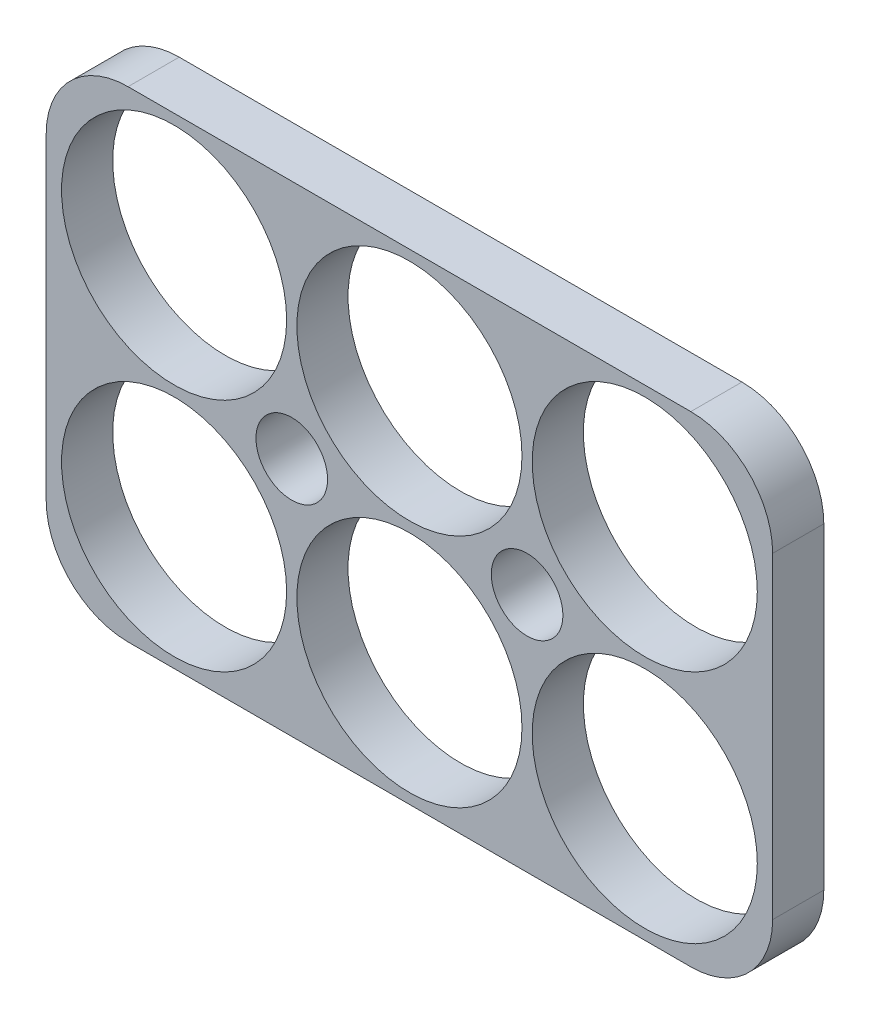
ISO-10303-21;
HEADER;
FILE_DESCRIPTION(('STEP AP214'),'2;1');
FILE_NAME('part.step','',(''),(''),'','','');
FILE_SCHEMA(('AUTOMOTIVE_DESIGN { 1 0 10303 214 1 1 1 1 }'));
ENDSEC;
DATA;
#1=APPLICATION_CONTEXT('core data for automotive mechanical design processes');
#2=APPLICATION_PROTOCOL_DEFINITION('international standard','automotive_design',2000,#1);
#3=PRODUCT_CONTEXT('',#1,'mechanical');
#4=PRODUCT('Part','Part','',(#3));
#5=PRODUCT_RELATED_PRODUCT_CATEGORY('part','',(#4));
#6=PRODUCT_DEFINITION_FORMATION('','',#4);
#7=PRODUCT_DEFINITION_CONTEXT('part definition',#1,'design');
#8=PRODUCT_DEFINITION('design','',#6,#7);
#9=PRODUCT_DEFINITION_SHAPE('','',#8);
#10=(LENGTH_UNIT() NAMED_UNIT(*) SI_UNIT(.MILLI.,.METRE.));
#11=(NAMED_UNIT(*) PLANE_ANGLE_UNIT() SI_UNIT($,.RADIAN.));
#12=(NAMED_UNIT(*) SI_UNIT($,.STERADIAN.) SOLID_ANGLE_UNIT());
#13=UNCERTAINTY_MEASURE_WITH_UNIT(LENGTH_MEASURE(1.E-05),#10,'distance_accuracy_value','');
#14=(GEOMETRIC_REPRESENTATION_CONTEXT(3) GLOBAL_UNCERTAINTY_ASSIGNED_CONTEXT((#13)) GLOBAL_UNIT_ASSIGNED_CONTEXT((#10,
#11,#12)) REPRESENTATION_CONTEXT('',''));
#15=CARTESIAN_POINT('',(0.,0.,0.));
#16=DIRECTION('',(0.,0.,1.));
#17=DIRECTION('',(1.,0.,0.));
#18=AXIS2_PLACEMENT_3D('',#15,#16,#17);
#19=CARTESIAN_POINT('',(35.5,23.5,-5.));
#20=DIRECTION('',(1.,0.,0.));
#21=DIRECTION('',(0.,0.,-1.));
#22=AXIS2_PLACEMENT_3D('',#19,#20,#21);
#23=PLANE('',#22);
#24=DIRECTION('',(0.,1.,0.));
#25=VECTOR('',#24,1.);
#26=CARTESIAN_POINT('',(35.5,23.5,0.));
#27=LINE('',#26,#25);
#28=CARTESIAN_POINT('',(35.5,-15.5,0.));
#29=VERTEX_POINT('',#28);
#30=CARTESIAN_POINT('',(35.5,15.5,0.));
#31=VERTEX_POINT('',#30);
#32=EDGE_CURVE('E184',#29,#31,#27,.T.);
#33=ORIENTED_EDGE('',*,*,#32,.F.);
#34=DIRECTION('',(0.,0.,1.));
#35=VECTOR('',#34,1.);
#36=CARTESIAN_POINT('',(35.5,-15.5,-5.));
#37=LINE('',#36,#35);
#38=CARTESIAN_POINT('',(35.5,-15.5,-5.));
#39=VERTEX_POINT('',#38);
#40=EDGE_CURVE('E168',#29,#39,#37,.F.);
#41=ORIENTED_EDGE('',*,*,#40,.T.);
#42=DIRECTION('',(0.,1.,0.));
#43=VECTOR('',#42,1.);
#44=CARTESIAN_POINT('',(35.5,23.5,-5.));
#45=LINE('',#44,#43);
#46=CARTESIAN_POINT('',(35.5,15.5,-5.));
#47=VERTEX_POINT('',#46);
#48=EDGE_CURVE('E175',#39,#47,#45,.T.);
#49=ORIENTED_EDGE('',*,*,#48,.T.);
#50=DIRECTION('',(0.,0.,1.));
#51=VECTOR('',#50,1.);
#52=CARTESIAN_POINT('',(35.5,15.5,-5.));
#53=LINE('',#52,#51);
#54=EDGE_CURVE('E164',#47,#31,#53,.T.);
#55=ORIENTED_EDGE('',*,*,#54,.T.);
#56=EDGE_LOOP('',(#33,#41,#49,#55));
#57=FACE_BOUND('',#56,.T.);
#58=ADVANCED_FACE('F39',(#57),#23,.T.);
#59=CARTESIAN_POINT('',(-35.5,-23.5,-5.));
#60=DIRECTION('',(0.,-1.,0.));
#61=DIRECTION('',(0.,0.,-1.));
#62=AXIS2_PLACEMENT_3D('',#59,#60,#61);
#63=PLANE('',#62);
#64=DIRECTION('',(1.,0.,0.));
#65=VECTOR('',#64,1.);
#66=CARTESIAN_POINT('',(-35.5,-23.5,0.));
#67=LINE('',#66,#65);
#68=CARTESIAN_POINT('',(-27.5,-23.5,0.));
#69=VERTEX_POINT('',#68);
#70=CARTESIAN_POINT('',(27.5,-23.5,0.));
#71=VERTEX_POINT('',#70);
#72=EDGE_CURVE('E125',#69,#71,#67,.T.);
#73=ORIENTED_EDGE('',*,*,#72,.F.);
#74=DIRECTION('',(0.,0.,1.));
#75=VECTOR('',#74,1.);
#76=CARTESIAN_POINT('',(-27.5,-23.5,-5.));
#77=LINE('',#76,#75);
#78=CARTESIAN_POINT('',(-27.5,-23.5,-5.));
#79=VERTEX_POINT('',#78);
#80=EDGE_CURVE('E150',#69,#79,#77,.F.);
#81=ORIENTED_EDGE('',*,*,#80,.T.);
#82=DIRECTION('',(1.,0.,0.));
#83=VECTOR('',#82,1.);
#84=CARTESIAN_POINT('',(-35.5,-23.5,-5.));
#85=LINE('',#84,#83);
#86=CARTESIAN_POINT('',(27.5,-23.5,-5.));
#87=VERTEX_POINT('',#86);
#88=EDGE_CURVE('E128',#79,#87,#85,.T.);
#89=ORIENTED_EDGE('',*,*,#88,.T.);
#90=DIRECTION('',(0.,0.,1.));
#91=VECTOR('',#90,1.);
#92=CARTESIAN_POINT('',(27.5,-23.5,-5.));
#93=LINE('',#92,#91);
#94=EDGE_CURVE('E146',#87,#71,#93,.T.);
#95=ORIENTED_EDGE('',*,*,#94,.T.);
#96=EDGE_LOOP('',(#73,#81,#89,#95));
#97=FACE_BOUND('',#96,.T.);
#98=ADVANCED_FACE('F289',(#97),#63,.T.);
#99=CARTESIAN_POINT('',(-35.5,23.5,-5.));
#100=DIRECTION('',(-1.,0.,0.));
#101=DIRECTION('',(0.,0.,1.));
#102=AXIS2_PLACEMENT_3D('',#99,#100,#101);
#103=PLANE('',#102);
#104=DIRECTION('',(0.,-1.,0.));
#105=VECTOR('',#104,1.);
#106=CARTESIAN_POINT('',(-35.5,23.5,-5.));
#107=LINE('',#106,#105);
#108=CARTESIAN_POINT('',(-35.5,15.5,-5.));
#109=VERTEX_POINT('',#108);
#110=CARTESIAN_POINT('',(-35.5,-15.5,-5.));
#111=VERTEX_POINT('',#110);
#112=EDGE_CURVE('E134',#109,#111,#107,.T.);
#113=ORIENTED_EDGE('',*,*,#112,.T.);
#114=DIRECTION('',(0.,0.,1.));
#115=VECTOR('',#114,1.);
#116=CARTESIAN_POINT('',(-35.5,-15.5,-5.));
#117=LINE('',#116,#115);
#118=CARTESIAN_POINT('',(-35.5,-15.5,0.));
#119=VERTEX_POINT('',#118);
#120=EDGE_CURVE('E116',#111,#119,#117,.T.);
#121=ORIENTED_EDGE('',*,*,#120,.T.);
#122=DIRECTION('',(0.,-1.,0.));
#123=VECTOR('',#122,1.);
#124=CARTESIAN_POINT('',(-35.5,23.5,0.));
#125=LINE('',#124,#123);
#126=CARTESIAN_POINT('',(-35.5,15.5,0.));
#127=VERTEX_POINT('',#126);
#128=EDGE_CURVE('E108',#127,#119,#125,.T.);
#129=ORIENTED_EDGE('',*,*,#128,.F.);
#130=DIRECTION('',(0.,0.,1.));
#131=VECTOR('',#130,1.);
#132=CARTESIAN_POINT('',(-35.5,15.5,-5.));
#133=LINE('',#132,#131);
#134=EDGE_CURVE('E122',#127,#109,#133,.F.);
#135=ORIENTED_EDGE('',*,*,#134,.T.);
#136=EDGE_LOOP('',(#113,#121,#129,#135));
#137=FACE_BOUND('',#136,.T.);
#138=ADVANCED_FACE('F121',(#137),#103,.T.);
#139=CARTESIAN_POINT('',(-35.5,23.5,-5.));
#140=DIRECTION('',(0.,1.,0.));
#141=DIRECTION('',(0.,0.,1.));
#142=AXIS2_PLACEMENT_3D('',#139,#140,#141);
#143=PLANE('',#142);
#144=DIRECTION('',(-1.,0.,0.));
#145=VECTOR('',#144,1.);
#146=CARTESIAN_POINT('',(-35.5,23.5,0.));
#147=LINE('',#146,#145);
#148=CARTESIAN_POINT('',(27.5,23.5,0.));
#149=VERTEX_POINT('',#148);
#150=CARTESIAN_POINT('',(-27.5,23.5,0.));
#151=VERTEX_POINT('',#150);
#152=EDGE_CURVE('E109',#149,#151,#147,.T.);
#153=ORIENTED_EDGE('',*,*,#152,.F.);
#154=DIRECTION('',(0.,0.,1.));
#155=VECTOR('',#154,1.);
#156=CARTESIAN_POINT('',(27.5,23.5,-5.));
#157=LINE('',#156,#155);
#158=CARTESIAN_POINT('',(27.5,23.5,-5.));
#159=VERTEX_POINT('',#158);
#160=EDGE_CURVE('E11',#149,#159,#157,.F.);
#161=ORIENTED_EDGE('',*,*,#160,.T.);
#162=DIRECTION('',(-1.,0.,0.));
#163=VECTOR('',#162,1.);
#164=CARTESIAN_POINT('',(-35.5,23.5,-5.));
#165=LINE('',#164,#163);
#166=CARTESIAN_POINT('',(-27.5,23.5,-5.));
#167=VERTEX_POINT('',#166);
#168=EDGE_CURVE('E172',#159,#167,#165,.T.);
#169=ORIENTED_EDGE('',*,*,#168,.T.);
#170=DIRECTION('',(0.,0.,1.));
#171=VECTOR('',#170,1.);
#172=CARTESIAN_POINT('',(-27.5,23.5,-5.));
#173=LINE('',#172,#171);
#174=EDGE_CURVE('E48',#167,#151,#173,.T.);
#175=ORIENTED_EDGE('',*,*,#174,.T.);
#176=EDGE_LOOP('',(#153,#161,#169,#175));
#177=FACE_BOUND('',#176,.T.);
#178=ADVANCED_FACE('F171',(#177),#143,.T.);
#179=CARTESIAN_POINT('',(0.,0.,-5.));
#180=DIRECTION('',(0.,0.,1.));
#181=DIRECTION('',(1.,0.,0.));
#182=AXIS2_PLACEMENT_3D('',#179,#180,#181);
#183=PLANE('',#182);
#184=CARTESIAN_POINT('',(-11.5,0.,-5.));
#185=DIRECTION('',(0.,0.,1.));
#186=DIRECTION('',(1.,0.,0.));
#187=AXIS2_PLACEMENT_3D('',#184,#185,#186);
#188=CIRCLE('',#187,3.5);
#189=CARTESIAN_POINT('',(-8.,0.,-5.));
#190=VERTEX_POINT('',#189);
#191=EDGE_CURVE('E245',#190,#190,#188,.T.);
#192=ORIENTED_EDGE('',*,*,#191,.T.);
#193=EDGE_LOOP('',(#192));
#194=FACE_BOUND('',#193,.T.);
#195=CARTESIAN_POINT('',(11.5,0.,-5.));
#196=DIRECTION('',(0.,0.,1.));
#197=DIRECTION('',(1.,0.,0.));
#198=AXIS2_PLACEMENT_3D('',#195,#196,#197);
#199=CIRCLE('',#198,3.5);
#200=CARTESIAN_POINT('',(15.,0.,-5.));
#201=VERTEX_POINT('',#200);
#202=EDGE_CURVE('E237',#201,#201,#199,.T.);
#203=ORIENTED_EDGE('',*,*,#202,.T.);
#204=EDGE_LOOP('',(#203));
#205=FACE_BOUND('',#204,.T.);
#206=CARTESIAN_POINT('',(-23.,-11.5,-5.));
#207=DIRECTION('',(0.,0.,1.));
#208=DIRECTION('',(1.,0.,0.));
#209=AXIS2_PLACEMENT_3D('',#206,#207,#208);
#210=CIRCLE('',#209,11.);
#211=CARTESIAN_POINT('',(-12.,-11.5,-5.));
#212=VERTEX_POINT('',#211);
#213=EDGE_CURVE('E229',#212,#212,#210,.T.);
#214=ORIENTED_EDGE('',*,*,#213,.T.);
#215=EDGE_LOOP('',(#214));
#216=FACE_BOUND('',#215,.T.);
#217=CARTESIAN_POINT('',(0.,-11.5,-5.));
#218=DIRECTION('',(0.,0.,1.));
#219=DIRECTION('',(1.,0.,0.));
#220=AXIS2_PLACEMENT_3D('',#217,#218,#219);
#221=CIRCLE('',#220,11.);
#222=CARTESIAN_POINT('',(11.,-11.5,-5.));
#223=VERTEX_POINT('',#222);
#224=EDGE_CURVE('E221',#223,#223,#221,.T.);
#225=ORIENTED_EDGE('',*,*,#224,.T.);
#226=EDGE_LOOP('',(#225));
#227=FACE_BOUND('',#226,.T.);
#228=CARTESIAN_POINT('',(23.,-11.5,-5.));
#229=DIRECTION('',(0.,0.,1.));
#230=DIRECTION('',(1.,0.,0.));
#231=AXIS2_PLACEMENT_3D('',#228,#229,#230);
#232=CIRCLE('',#231,11.);
#233=CARTESIAN_POINT('',(34.,-11.5,-5.));
#234=VERTEX_POINT('',#233);
#235=EDGE_CURVE('E213',#234,#234,#232,.T.);
#236=ORIENTED_EDGE('',*,*,#235,.T.);
#237=EDGE_LOOP('',(#236));
#238=FACE_BOUND('',#237,.T.);
#239=CARTESIAN_POINT('',(23.,11.5,-5.));
#240=DIRECTION('',(0.,0.,1.));
#241=DIRECTION('',(1.,0.,0.));
#242=AXIS2_PLACEMENT_3D('',#239,#240,#241);
#243=CIRCLE('',#242,11.);
#244=CARTESIAN_POINT('',(34.,11.5,-5.));
#245=VERTEX_POINT('',#244);
#246=EDGE_CURVE('E205',#245,#245,#243,.T.);
#247=ORIENTED_EDGE('',*,*,#246,.T.);
#248=EDGE_LOOP('',(#247));
#249=FACE_BOUND('',#248,.T.);
#250=CARTESIAN_POINT('',(0.,11.5,-5.));
#251=DIRECTION('',(0.,0.,1.));
#252=DIRECTION('',(1.,0.,0.));
#253=AXIS2_PLACEMENT_3D('',#250,#251,#252);
#254=CIRCLE('',#253,11.);
#255=CARTESIAN_POINT('',(11.,11.5,-5.));
#256=VERTEX_POINT('',#255);
#257=EDGE_CURVE('E198',#256,#256,#254,.T.);
#258=ORIENTED_EDGE('',*,*,#257,.T.);
#259=EDGE_LOOP('',(#258));
#260=FACE_BOUND('',#259,.T.);
#261=CARTESIAN_POINT('',(-23.,11.5,-5.));
#262=DIRECTION('',(0.,0.,1.));
#263=DIRECTION('',(1.,0.,0.));
#264=AXIS2_PLACEMENT_3D('',#261,#262,#263);
#265=CIRCLE('',#264,11.);
#266=CARTESIAN_POINT('',(-12.,11.5,-5.));
#267=VERTEX_POINT('',#266);
#268=EDGE_CURVE('E188',#267,#267,#265,.T.);
#269=ORIENTED_EDGE('',*,*,#268,.T.);
#270=EDGE_LOOP('',(#269));
#271=FACE_BOUND('',#270,.T.);
#272=ORIENTED_EDGE('',*,*,#88,.F.);
#273=CARTESIAN_POINT('',(-27.5,-15.5,-5.));
#274=DIRECTION('',(0.,0.,1.));
#275=DIRECTION('',(1.,0.,0.));
#276=AXIS2_PLACEMENT_3D('',#273,#274,#275);
#277=CIRCLE('',#276,8.);
#278=EDGE_CURVE('E161',#79,#111,#277,.F.);
#279=ORIENTED_EDGE('',*,*,#278,.T.);
#280=ORIENTED_EDGE('',*,*,#112,.F.);
#281=CARTESIAN_POINT('',(-27.5,15.5,-5.));
#282=DIRECTION('',(0.,0.,1.));
#283=DIRECTION('',(1.,0.,0.));
#284=AXIS2_PLACEMENT_3D('',#281,#282,#283);
#285=CIRCLE('',#284,8.);
#286=EDGE_CURVE('E55',#109,#167,#285,.F.);
#287=ORIENTED_EDGE('',*,*,#286,.T.);
#288=ORIENTED_EDGE('',*,*,#168,.F.);
#289=CARTESIAN_POINT('',(27.5,15.5,-5.));
#290=DIRECTION('',(0.,0.,1.));
#291=DIRECTION('',(1.,0.,0.));
#292=AXIS2_PLACEMENT_3D('',#289,#290,#291);
#293=CIRCLE('',#292,8.);
#294=EDGE_CURVE('E155',#159,#47,#293,.F.);
#295=ORIENTED_EDGE('',*,*,#294,.T.);
#296=ORIENTED_EDGE('',*,*,#48,.F.);
#297=CARTESIAN_POINT('',(27.5,-15.5,-5.));
#298=DIRECTION('',(0.,0.,1.));
#299=DIRECTION('',(1.,0.,0.));
#300=AXIS2_PLACEMENT_3D('',#297,#298,#299);
#301=CIRCLE('',#300,8.);
#302=EDGE_CURVE('E158',#39,#87,#301,.F.);
#303=ORIENTED_EDGE('',*,*,#302,.T.);
#304=EDGE_LOOP('',(#272,#279,#280,#287,#288,#295,#296,#303));
#305=FACE_BOUND('',#304,.T.);
#306=ADVANCED_FACE('F260',(#194,#205,#216,#227,#238,#249,#260,#271,#305),#183,.F.);
#307=CARTESIAN_POINT('',(0.,0.,0.));
#308=DIRECTION('',(0.,0.,1.));
#309=DIRECTION('',(1.,0.,0.));
#310=AXIS2_PLACEMENT_3D('',#307,#308,#309);
#311=PLANE('',#310);
#312=CARTESIAN_POINT('',(-11.5,0.,0.));
#313=DIRECTION('',(0.,0.,1.));
#314=DIRECTION('',(1.,0.,0.));
#315=AXIS2_PLACEMENT_3D('',#312,#313,#314);
#316=CIRCLE('',#315,3.5);
#317=CARTESIAN_POINT('',(-8.,0.,0.));
#318=VERTEX_POINT('',#317);
#319=EDGE_CURVE('E249',#318,#318,#316,.T.);
#320=ORIENTED_EDGE('',*,*,#319,.F.);
#321=EDGE_LOOP('',(#320));
#322=FACE_BOUND('',#321,.T.);
#323=CARTESIAN_POINT('',(11.5,0.,0.));
#324=DIRECTION('',(0.,0.,1.));
#325=DIRECTION('',(1.,0.,0.));
#326=AXIS2_PLACEMENT_3D('',#323,#324,#325);
#327=CIRCLE('',#326,3.5);
#328=CARTESIAN_POINT('',(15.,0.,0.));
#329=VERTEX_POINT('',#328);
#330=EDGE_CURVE('E241',#329,#329,#327,.T.);
#331=ORIENTED_EDGE('',*,*,#330,.F.);
#332=EDGE_LOOP('',(#331));
#333=FACE_BOUND('',#332,.T.);
#334=CARTESIAN_POINT('',(-23.,-11.5,0.));
#335=DIRECTION('',(0.,0.,1.));
#336=DIRECTION('',(1.,0.,0.));
#337=AXIS2_PLACEMENT_3D('',#334,#335,#336);
#338=CIRCLE('',#337,11.);
#339=CARTESIAN_POINT('',(-12.,-11.5,0.));
#340=VERTEX_POINT('',#339);
#341=EDGE_CURVE('E233',#340,#340,#338,.T.);
#342=ORIENTED_EDGE('',*,*,#341,.F.);
#343=EDGE_LOOP('',(#342));
#344=FACE_BOUND('',#343,.T.);
#345=CARTESIAN_POINT('',(0.,-11.5,0.));
#346=DIRECTION('',(0.,0.,1.));
#347=DIRECTION('',(1.,0.,0.));
#348=AXIS2_PLACEMENT_3D('',#345,#346,#347);
#349=CIRCLE('',#348,11.);
#350=CARTESIAN_POINT('',(11.,-11.5,0.));
#351=VERTEX_POINT('',#350);
#352=EDGE_CURVE('E225',#351,#351,#349,.T.);
#353=ORIENTED_EDGE('',*,*,#352,.F.);
#354=EDGE_LOOP('',(#353));
#355=FACE_BOUND('',#354,.T.);
#356=CARTESIAN_POINT('',(23.,-11.5,0.));
#357=DIRECTION('',(0.,0.,1.));
#358=DIRECTION('',(1.,0.,0.));
#359=AXIS2_PLACEMENT_3D('',#356,#357,#358);
#360=CIRCLE('',#359,11.);
#361=CARTESIAN_POINT('',(34.,-11.5,0.));
#362=VERTEX_POINT('',#361);
#363=EDGE_CURVE('E217',#362,#362,#360,.T.);
#364=ORIENTED_EDGE('',*,*,#363,.F.);
#365=EDGE_LOOP('',(#364));
#366=FACE_BOUND('',#365,.T.);
#367=CARTESIAN_POINT('',(23.,11.5,0.));
#368=DIRECTION('',(0.,0.,1.));
#369=DIRECTION('',(1.,0.,0.));
#370=AXIS2_PLACEMENT_3D('',#367,#368,#369);
#371=CIRCLE('',#370,11.);
#372=CARTESIAN_POINT('',(34.,11.5,0.));
#373=VERTEX_POINT('',#372);
#374=EDGE_CURVE('E209',#373,#373,#371,.T.);
#375=ORIENTED_EDGE('',*,*,#374,.F.);
#376=EDGE_LOOP('',(#375));
#377=FACE_BOUND('',#376,.T.);
#378=CARTESIAN_POINT('',(0.,11.5,0.));
#379=DIRECTION('',(0.,0.,1.));
#380=DIRECTION('',(1.,0.,0.));
#381=AXIS2_PLACEMENT_3D('',#378,#379,#380);
#382=CIRCLE('',#381,11.);
#383=CARTESIAN_POINT('',(11.,11.5,0.));
#384=VERTEX_POINT('',#383);
#385=EDGE_CURVE('E201',#384,#384,#382,.T.);
#386=ORIENTED_EDGE('',*,*,#385,.F.);
#387=EDGE_LOOP('',(#386));
#388=FACE_BOUND('',#387,.T.);
#389=CARTESIAN_POINT('',(-23.,11.5,0.));
#390=DIRECTION('',(0.,0.,1.));
#391=DIRECTION('',(1.,0.,0.));
#392=AXIS2_PLACEMENT_3D('',#389,#390,#391);
#393=CIRCLE('',#392,11.);
#394=CARTESIAN_POINT('',(-12.,11.5,0.));
#395=VERTEX_POINT('',#394);
#396=EDGE_CURVE('E194',#395,#395,#393,.T.);
#397=ORIENTED_EDGE('',*,*,#396,.F.);
#398=EDGE_LOOP('',(#397));
#399=FACE_BOUND('',#398,.T.);
#400=ORIENTED_EDGE('',*,*,#128,.T.);
#401=CARTESIAN_POINT('',(-27.5,-15.5,0.));
#402=DIRECTION('',(0.,0.,1.));
#403=DIRECTION('',(1.,0.,0.));
#404=AXIS2_PLACEMENT_3D('',#401,#402,#403);
#405=CIRCLE('',#404,8.);
#406=EDGE_CURVE('E143',#119,#69,#405,.T.);
#407=ORIENTED_EDGE('',*,*,#406,.T.);
#408=ORIENTED_EDGE('',*,*,#72,.T.);
#409=CARTESIAN_POINT('',(27.5,-15.5,0.));
#410=DIRECTION('',(0.,0.,1.));
#411=DIRECTION('',(1.,0.,0.));
#412=AXIS2_PLACEMENT_3D('',#409,#410,#411);
#413=CIRCLE('',#412,8.);
#414=EDGE_CURVE('E140',#71,#29,#413,.T.);
#415=ORIENTED_EDGE('',*,*,#414,.T.);
#416=ORIENTED_EDGE('',*,*,#32,.T.);
#417=CARTESIAN_POINT('',(27.5,15.5,0.));
#418=DIRECTION('',(0.,0.,1.));
#419=DIRECTION('',(1.,0.,0.));
#420=AXIS2_PLACEMENT_3D('',#417,#418,#419);
#421=CIRCLE('',#420,8.);
#422=EDGE_CURVE('E115',#31,#149,#421,.T.);
#423=ORIENTED_EDGE('',*,*,#422,.T.);
#424=ORIENTED_EDGE('',*,*,#152,.T.);
#425=CARTESIAN_POINT('',(-27.5,15.5,0.));
#426=DIRECTION('',(0.,0.,1.));
#427=DIRECTION('',(1.,0.,0.));
#428=AXIS2_PLACEMENT_3D('',#425,#426,#427);
#429=CIRCLE('',#428,8.);
#430=EDGE_CURVE('E105',#151,#127,#429,.T.);
#431=ORIENTED_EDGE('',*,*,#430,.T.);
#432=EDGE_LOOP('',(#400,#407,#408,#415,#416,#423,#424,#431));
#433=FACE_BOUND('',#432,.T.);
#434=ADVANCED_FACE('F107',(#322,#333,#344,#355,#366,#377,#388,#399,#433),#311,.T.);
#435=CARTESIAN_POINT('',(-23.,11.5,-5.));
#436=DIRECTION('',(0.,0.,1.));
#437=DIRECTION('',(1.,0.,0.));
#438=AXIS2_PLACEMENT_3D('',#435,#436,#437);
#439=CYLINDRICAL_SURFACE('',#438,11.);
#440=ORIENTED_EDGE('',*,*,#268,.F.);
#441=EDGE_LOOP('',(#440));
#442=FACE_BOUND('',#441,.T.);
#443=ORIENTED_EDGE('',*,*,#396,.T.);
#444=EDGE_LOOP('',(#443));
#445=FACE_BOUND('',#444,.T.);
#446=ADVANCED_FACE('F259',(#442,#445),#439,.F.);
#447=CARTESIAN_POINT('',(0.,11.5,-5.));
#448=DIRECTION('',(0.,0.,1.));
#449=DIRECTION('',(1.,0.,0.));
#450=AXIS2_PLACEMENT_3D('',#447,#448,#449);
#451=CYLINDRICAL_SURFACE('',#450,11.);
#452=ORIENTED_EDGE('',*,*,#257,.F.);
#453=EDGE_LOOP('',(#452));
#454=FACE_BOUND('',#453,.T.);
#455=ORIENTED_EDGE('',*,*,#385,.T.);
#456=EDGE_LOOP('',(#455));
#457=FACE_BOUND('',#456,.T.);
#458=ADVANCED_FACE('F277',(#454,#457),#451,.F.);
#459=CARTESIAN_POINT('',(23.,11.5,-5.));
#460=DIRECTION('',(0.,0.,1.));
#461=DIRECTION('',(1.,0.,0.));
#462=AXIS2_PLACEMENT_3D('',#459,#460,#461);
#463=CYLINDRICAL_SURFACE('',#462,11.);
#464=ORIENTED_EDGE('',*,*,#246,.F.);
#465=EDGE_LOOP('',(#464));
#466=FACE_BOUND('',#465,.T.);
#467=ORIENTED_EDGE('',*,*,#374,.T.);
#468=EDGE_LOOP('',(#467));
#469=FACE_BOUND('',#468,.T.);
#470=ADVANCED_FACE('F283',(#466,#469),#463,.F.);
#471=CARTESIAN_POINT('',(23.,-11.5,-5.));
#472=DIRECTION('',(0.,0.,1.));
#473=DIRECTION('',(1.,0.,0.));
#474=AXIS2_PLACEMENT_3D('',#471,#472,#473);
#475=CYLINDRICAL_SURFACE('',#474,11.);
#476=ORIENTED_EDGE('',*,*,#235,.F.);
#477=EDGE_LOOP('',(#476));
#478=FACE_BOUND('',#477,.T.);
#479=ORIENTED_EDGE('',*,*,#363,.T.);
#480=EDGE_LOOP('',(#479));
#481=FACE_BOUND('',#480,.T.);
#482=ADVANCED_FACE('F404',(#478,#481),#475,.F.);
#483=CARTESIAN_POINT('',(0.,-11.5,-5.));
#484=DIRECTION('',(0.,0.,1.));
#485=DIRECTION('',(1.,0.,0.));
#486=AXIS2_PLACEMENT_3D('',#483,#484,#485);
#487=CYLINDRICAL_SURFACE('',#486,11.);
#488=ORIENTED_EDGE('',*,*,#224,.F.);
#489=EDGE_LOOP('',(#488));
#490=FACE_BOUND('',#489,.T.);
#491=ORIENTED_EDGE('',*,*,#352,.T.);
#492=EDGE_LOOP('',(#491));
#493=FACE_BOUND('',#492,.T.);
#494=ADVANCED_FACE('F396',(#490,#493),#487,.F.);
#495=CARTESIAN_POINT('',(-23.,-11.5,-5.));
#496=DIRECTION('',(0.,0.,1.));
#497=DIRECTION('',(1.,0.,0.));
#498=AXIS2_PLACEMENT_3D('',#495,#496,#497);
#499=CYLINDRICAL_SURFACE('',#498,11.);
#500=ORIENTED_EDGE('',*,*,#213,.F.);
#501=EDGE_LOOP('',(#500));
#502=FACE_BOUND('',#501,.T.);
#503=ORIENTED_EDGE('',*,*,#341,.T.);
#504=EDGE_LOOP('',(#503));
#505=FACE_BOUND('',#504,.T.);
#506=ADVANCED_FACE('F388',(#502,#505),#499,.F.);
#507=CARTESIAN_POINT('',(11.5,0.,-5.));
#508=DIRECTION('',(0.,0.,1.));
#509=DIRECTION('',(1.,0.,0.));
#510=AXIS2_PLACEMENT_3D('',#507,#508,#509);
#511=CYLINDRICAL_SURFACE('',#510,3.5);
#512=ORIENTED_EDGE('',*,*,#202,.F.);
#513=EDGE_LOOP('',(#512));
#514=FACE_BOUND('',#513,.T.);
#515=ORIENTED_EDGE('',*,*,#330,.T.);
#516=EDGE_LOOP('',(#515));
#517=FACE_BOUND('',#516,.T.);
#518=ADVANCED_FACE('F381',(#514,#517),#511,.F.);
#519=CARTESIAN_POINT('',(-11.5,0.,-5.));
#520=DIRECTION('',(0.,0.,1.));
#521=DIRECTION('',(1.,0.,0.));
#522=AXIS2_PLACEMENT_3D('',#519,#520,#521);
#523=CYLINDRICAL_SURFACE('',#522,3.5);
#524=ORIENTED_EDGE('',*,*,#191,.F.);
#525=EDGE_LOOP('',(#524));
#526=FACE_BOUND('',#525,.T.);
#527=ORIENTED_EDGE('',*,*,#319,.T.);
#528=EDGE_LOOP('',(#527));
#529=FACE_BOUND('',#528,.T.);
#530=ADVANCED_FACE('F255',(#526,#529),#523,.F.);
#531=CARTESIAN_POINT('',(-27.5,-15.5,-5.));
#532=DIRECTION('',(0.,0.,1.));
#533=DIRECTION('',(1.,0.,0.));
#534=AXIS2_PLACEMENT_3D('',#531,#532,#533);
#535=CYLINDRICAL_SURFACE('',#534,8.);
#536=ORIENTED_EDGE('',*,*,#278,.F.);
#537=ORIENTED_EDGE('',*,*,#80,.F.);
#538=ORIENTED_EDGE('',*,*,#406,.F.);
#539=ORIENTED_EDGE('',*,*,#120,.F.);
#540=EDGE_LOOP('',(#536,#537,#538,#539));
#541=FACE_BOUND('',#540,.T.);
#542=ADVANCED_FACE('F301',(#541),#535,.T.);
#543=CARTESIAN_POINT('',(27.5,-15.5,-5.));
#544=DIRECTION('',(0.,0.,1.));
#545=DIRECTION('',(1.,0.,0.));
#546=AXIS2_PLACEMENT_3D('',#543,#544,#545);
#547=CYLINDRICAL_SURFACE('',#546,8.);
#548=ORIENTED_EDGE('',*,*,#302,.F.);
#549=ORIENTED_EDGE('',*,*,#40,.F.);
#550=ORIENTED_EDGE('',*,*,#414,.F.);
#551=ORIENTED_EDGE('',*,*,#94,.F.);
#552=EDGE_LOOP('',(#548,#549,#550,#551));
#553=FACE_BOUND('',#552,.T.);
#554=ADVANCED_FACE('F304',(#553),#547,.T.);
#555=CARTESIAN_POINT('',(27.5,15.5,-5.));
#556=DIRECTION('',(0.,0.,1.));
#557=DIRECTION('',(1.,0.,0.));
#558=AXIS2_PLACEMENT_3D('',#555,#556,#557);
#559=CYLINDRICAL_SURFACE('',#558,8.);
#560=ORIENTED_EDGE('',*,*,#294,.F.);
#561=ORIENTED_EDGE('',*,*,#160,.F.);
#562=ORIENTED_EDGE('',*,*,#422,.F.);
#563=ORIENTED_EDGE('',*,*,#54,.F.);
#564=EDGE_LOOP('',(#560,#561,#562,#563));
#565=FACE_BOUND('',#564,.T.);
#566=ADVANCED_FACE('F307',(#565),#559,.T.);
#567=CARTESIAN_POINT('',(-27.5,15.5,-5.));
#568=DIRECTION('',(0.,0.,1.));
#569=DIRECTION('',(1.,0.,0.));
#570=AXIS2_PLACEMENT_3D('',#567,#568,#569);
#571=CYLINDRICAL_SURFACE('',#570,8.);
#572=ORIENTED_EDGE('',*,*,#286,.F.);
#573=ORIENTED_EDGE('',*,*,#134,.F.);
#574=ORIENTED_EDGE('',*,*,#430,.F.);
#575=ORIENTED_EDGE('',*,*,#174,.F.);
#576=EDGE_LOOP('',(#572,#573,#574,#575));
#577=FACE_BOUND('',#576,.T.);
#578=ADVANCED_FACE('F41',(#577),#571,.T.);
#579=CLOSED_SHELL('',(#58,#98,#138,#178,#306,#434,#446,#458,#470,#482,#494,#506,#518,#530,#542,
#554,#566,#578));
#580=MANIFOLD_SOLID_BREP('B2',#579);
#581=ADVANCED_BREP_SHAPE_REPRESENTATION('',(#18,#580),#14);
#582=SHAPE_DEFINITION_REPRESENTATION(#9,#581);
ENDSEC;
END-ISO-10303-21;
